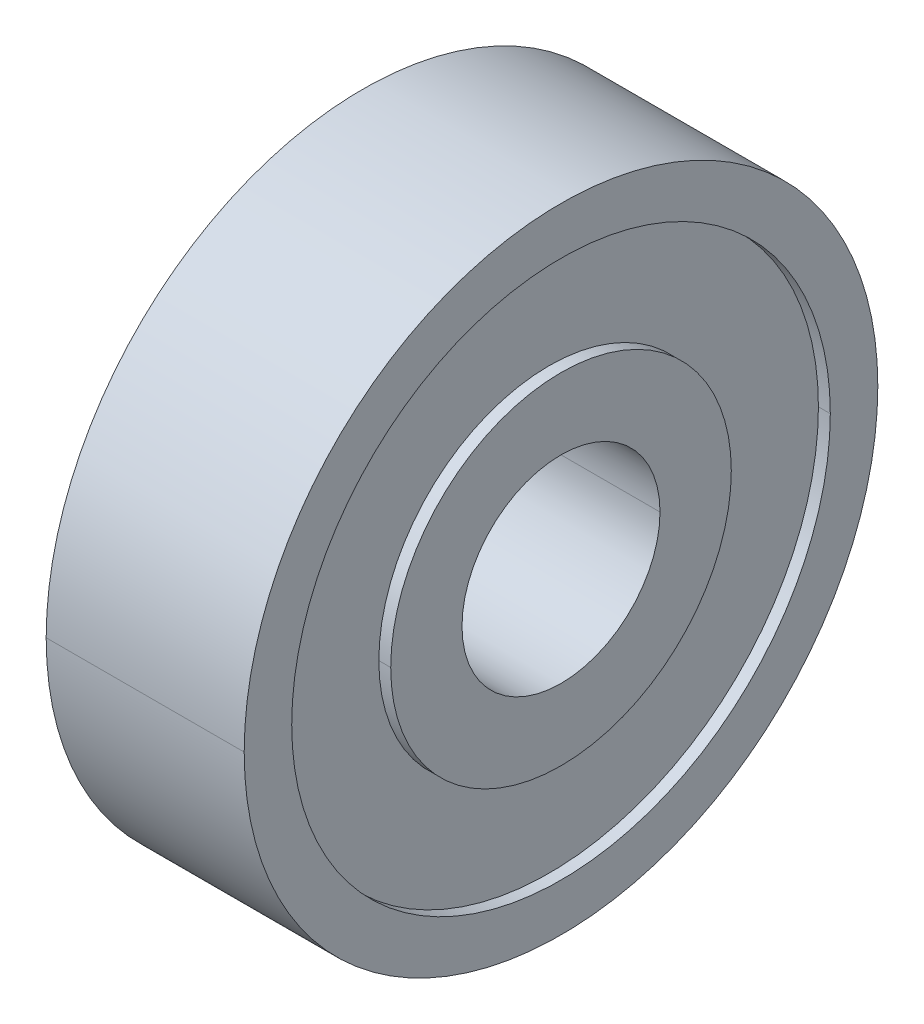
ISO-10303-21;
HEADER;
FILE_DESCRIPTION(('STEP AP214'),'2;1');
FILE_NAME('part.step','',(''),(''),'','','');
FILE_SCHEMA(('AUTOMOTIVE_DESIGN { 1 0 10303 214 1 1 1 1 }'));
ENDSEC;
DATA;
#1=APPLICATION_CONTEXT('core data for automotive mechanical design processes');
#2=APPLICATION_PROTOCOL_DEFINITION('international standard','automotive_design',2000,#1);
#3=PRODUCT_CONTEXT('',#1,'mechanical');
#4=PRODUCT('Part','Part','',(#3));
#5=PRODUCT_RELATED_PRODUCT_CATEGORY('part','',(#4));
#6=PRODUCT_DEFINITION_FORMATION('','',#4);
#7=PRODUCT_DEFINITION_CONTEXT('part definition',#1,'design');
#8=PRODUCT_DEFINITION('design','',#6,#7);
#9=PRODUCT_DEFINITION_SHAPE('','',#8);
#10=(LENGTH_UNIT() NAMED_UNIT(*) SI_UNIT(.MILLI.,.METRE.));
#11=(NAMED_UNIT(*) PLANE_ANGLE_UNIT() SI_UNIT($,.RADIAN.));
#12=(NAMED_UNIT(*) SI_UNIT($,.STERADIAN.) SOLID_ANGLE_UNIT());
#13=UNCERTAINTY_MEASURE_WITH_UNIT(LENGTH_MEASURE(1.E-05),#10,'distance_accuracy_value','');
#14=(GEOMETRIC_REPRESENTATION_CONTEXT(3) GLOBAL_UNCERTAINTY_ASSIGNED_CONTEXT((#13)) GLOBAL_UNIT_ASSIGNED_CONTEXT((#10,
#11,#12)) REPRESENTATION_CONTEXT('',''));
#15=CARTESIAN_POINT('',(0.,0.,0.));
#16=DIRECTION('',(0.,0.,1.));
#17=DIRECTION('',(1.,0.,0.));
#18=AXIS2_PLACEMENT_3D('',#15,#16,#17);
#19=CARTESIAN_POINT('',(0.,0.,0.));
#20=DIRECTION('',(1.,0.,0.));
#21=DIRECTION('',(0.,0.,-1.));
#22=AXIS2_PLACEMENT_3D('',#19,#20,#21);
#23=CYLINDRICAL_SURFACE('',#22,2.5);
#24=DIRECTION('',(1.,0.,0.));
#25=VECTOR('',#24,1.);
#26=CARTESIAN_POINT('',(0.,0.,2.5));
#27=LINE('',#26,#25);
#28=CARTESIAN_POINT('',(-2.5,0.,2.5));
#29=VERTEX_POINT('',#28);
#30=CARTESIAN_POINT('',(2.5,0.,2.5));
#31=VERTEX_POINT('',#30);
#32=EDGE_CURVE('E232',#29,#31,#27,.T.);
#33=ORIENTED_EDGE('',*,*,#32,.F.);
#34=CARTESIAN_POINT('',(-2.5,0.,0.));
#35=DIRECTION('',(1.,0.,0.));
#36=DIRECTION('',(0.,0.,-1.));
#37=AXIS2_PLACEMENT_3D('',#34,#35,#36);
#38=CIRCLE('',#37,2.5);
#39=CARTESIAN_POINT('',(-2.5,0.,-2.5));
#40=VERTEX_POINT('',#39);
#41=EDGE_CURVE('E233',#40,#29,#38,.T.);
#42=ORIENTED_EDGE('',*,*,#41,.F.);
#43=DIRECTION('',(1.,0.,0.));
#44=VECTOR('',#43,1.);
#45=CARTESIAN_POINT('',(0.,0.,-2.5));
#46=LINE('',#45,#44);
#47=CARTESIAN_POINT('',(2.5,0.,-2.5));
#48=VERTEX_POINT('',#47);
#49=EDGE_CURVE('E210',#40,#48,#46,.T.);
#50=ORIENTED_EDGE('',*,*,#49,.T.);
#51=CARTESIAN_POINT('',(2.5,0.,0.));
#52=DIRECTION('',(1.,0.,0.));
#53=DIRECTION('',(0.,0.,-1.));
#54=AXIS2_PLACEMENT_3D('',#51,#52,#53);
#55=CIRCLE('',#54,2.5);
#56=EDGE_CURVE('E11',#48,#31,#55,.T.);
#57=ORIENTED_EDGE('',*,*,#56,.T.);
#58=EDGE_LOOP('',(#33,#42,#50,#57));
#59=FACE_BOUND('',#58,.T.);
#60=ADVANCED_FACE('F16',(#59),#23,.F.);
#61=CARTESIAN_POINT('',(2.5,2.5,0.));
#62=DIRECTION('',(1.,0.,0.));
#63=DIRECTION('',(0.,1.,0.));
#64=AXIS2_PLACEMENT_3D('',#61,#62,#63);
#65=PLANE('',#64);
#66=ORIENTED_EDGE('',*,*,#56,.F.);
#67=CARTESIAN_POINT('',(2.5,0.,0.));
#68=DIRECTION('',(1.,0.,0.));
#69=DIRECTION('',(0.,0.,-1.));
#70=AXIS2_PLACEMENT_3D('',#67,#68,#69);
#71=CIRCLE('',#70,2.5);
#72=EDGE_CURVE('E228',#31,#48,#71,.T.);
#73=ORIENTED_EDGE('',*,*,#72,.F.);
#74=EDGE_LOOP('',(#66,#73));
#75=FACE_BOUND('',#74,.T.);
#76=CARTESIAN_POINT('',(2.5,0.,0.));
#77=DIRECTION('',(1.,0.,0.));
#78=DIRECTION('',(0.,0.,-1.));
#79=AXIS2_PLACEMENT_3D('',#76,#77,#78);
#80=CIRCLE('',#79,4.3);
#81=CARTESIAN_POINT('',(2.5,0.,-4.3));
#82=VERTEX_POINT('',#81);
#83=CARTESIAN_POINT('',(2.5,0.,4.3));
#84=VERTEX_POINT('',#83);
#85=EDGE_CURVE('E196',#82,#84,#80,.T.);
#86=ORIENTED_EDGE('',*,*,#85,.T.);
#87=CARTESIAN_POINT('',(2.5,0.,0.));
#88=DIRECTION('',(1.,0.,0.));
#89=DIRECTION('',(0.,0.,-1.));
#90=AXIS2_PLACEMENT_3D('',#87,#88,#89);
#91=CIRCLE('',#90,4.3);
#92=EDGE_CURVE('E27',#84,#82,#91,.T.);
#93=ORIENTED_EDGE('',*,*,#92,.T.);
#94=EDGE_LOOP('',(#86,#93));
#95=FACE_BOUND('',#94,.T.);
#96=ADVANCED_FACE('F324',(#75,#95),#65,.T.);
#97=CARTESIAN_POINT('',(0.,0.,0.));
#98=DIRECTION('',(1.,0.,0.));
#99=DIRECTION('',(0.,0.,-1.));
#100=AXIS2_PLACEMENT_3D('',#97,#98,#99);
#101=CYLINDRICAL_SURFACE('',#100,4.3);
#102=DIRECTION('',(1.,0.,0.));
#103=VECTOR('',#102,1.);
#104=CARTESIAN_POINT('',(0.,0.,4.3));
#105=LINE('',#104,#103);
#106=CARTESIAN_POINT('',(2.2,0.,4.3));
#107=VERTEX_POINT('',#106);
#108=EDGE_CURVE('E206',#107,#84,#105,.T.);
#109=ORIENTED_EDGE('',*,*,#108,.F.);
#110=CARTESIAN_POINT('',(2.2,0.,0.));
#111=DIRECTION('',(1.,0.,0.));
#112=DIRECTION('',(0.,0.,-1.));
#113=AXIS2_PLACEMENT_3D('',#110,#111,#112);
#114=CIRCLE('',#113,4.3);
#115=CARTESIAN_POINT('',(2.2,0.,-4.3));
#116=VERTEX_POINT('',#115);
#117=EDGE_CURVE('E106',#107,#116,#114,.T.);
#118=ORIENTED_EDGE('',*,*,#117,.T.);
#119=DIRECTION('',(1.,0.,0.));
#120=VECTOR('',#119,1.);
#121=CARTESIAN_POINT('',(0.,0.,-4.3));
#122=LINE('',#121,#120);
#123=EDGE_CURVE('E188',#116,#82,#122,.T.);
#124=ORIENTED_EDGE('',*,*,#123,.T.);
#125=ORIENTED_EDGE('',*,*,#92,.F.);
#126=EDGE_LOOP('',(#109,#118,#124,#125));
#127=FACE_BOUND('',#126,.T.);
#128=ADVANCED_FACE('F330',(#127),#101,.T.);
#129=CARTESIAN_POINT('',(2.2,4.3,0.));
#130=DIRECTION('',(1.,0.,0.));
#131=DIRECTION('',(0.,1.,0.));
#132=AXIS2_PLACEMENT_3D('',#129,#130,#131);
#133=PLANE('',#132);
#134=CARTESIAN_POINT('',(2.2,0.,0.));
#135=DIRECTION('',(1.,0.,0.));
#136=DIRECTION('',(0.,0.,-1.));
#137=AXIS2_PLACEMENT_3D('',#134,#135,#136);
#138=CIRCLE('',#137,4.3);
#139=EDGE_CURVE('E279',#116,#107,#138,.T.);
#140=ORIENTED_EDGE('',*,*,#139,.F.);
#141=ORIENTED_EDGE('',*,*,#117,.F.);
#142=EDGE_LOOP('',(#140,#141));
#143=FACE_BOUND('',#142,.T.);
#144=CARTESIAN_POINT('',(2.2,0.,0.));
#145=DIRECTION('',(1.,0.,0.));
#146=DIRECTION('',(0.,0.,-1.));
#147=AXIS2_PLACEMENT_3D('',#144,#145,#146);
#148=CIRCLE('',#147,6.8);
#149=CARTESIAN_POINT('',(2.2,0.,-6.8));
#150=VERTEX_POINT('',#149);
#151=CARTESIAN_POINT('',(2.2,0.,6.8));
#152=VERTEX_POINT('',#151);
#153=EDGE_CURVE('E168',#150,#152,#148,.T.);
#154=ORIENTED_EDGE('',*,*,#153,.T.);
#155=CARTESIAN_POINT('',(2.2,0.,0.));
#156=DIRECTION('',(1.,0.,0.));
#157=DIRECTION('',(0.,0.,-1.));
#158=AXIS2_PLACEMENT_3D('',#155,#156,#157);
#159=CIRCLE('',#158,6.8);
#160=EDGE_CURVE('E20',#152,#150,#159,.T.);
#161=ORIENTED_EDGE('',*,*,#160,.T.);
#162=EDGE_LOOP('',(#154,#161));
#163=FACE_BOUND('',#162,.T.);
#164=ADVANCED_FACE('F186',(#143,#163),#133,.T.);
#165=CARTESIAN_POINT('',(0.,0.,0.));
#166=DIRECTION('',(1.,0.,0.));
#167=DIRECTION('',(0.,0.,-1.));
#168=AXIS2_PLACEMENT_3D('',#165,#166,#167);
#169=CYLINDRICAL_SURFACE('',#168,6.8);
#170=DIRECTION('',(1.,0.,0.));
#171=VECTOR('',#170,1.);
#172=CARTESIAN_POINT('',(0.,0.,6.8));
#173=LINE('',#172,#171);
#174=CARTESIAN_POINT('',(2.5,0.,6.8));
#175=VERTEX_POINT('',#174);
#176=EDGE_CURVE('E174',#152,#175,#173,.T.);
#177=ORIENTED_EDGE('',*,*,#176,.F.);
#178=ORIENTED_EDGE('',*,*,#153,.F.);
#179=DIRECTION('',(1.,0.,0.));
#180=VECTOR('',#179,1.);
#181=CARTESIAN_POINT('',(0.,0.,-6.8));
#182=LINE('',#181,#180);
#183=CARTESIAN_POINT('',(2.5,0.,-6.8));
#184=VERTEX_POINT('',#183);
#185=EDGE_CURVE('E171',#150,#184,#182,.T.);
#186=ORIENTED_EDGE('',*,*,#185,.T.);
#187=CARTESIAN_POINT('',(2.5,0.,0.));
#188=DIRECTION('',(1.,0.,0.));
#189=DIRECTION('',(0.,0.,-1.));
#190=AXIS2_PLACEMENT_3D('',#187,#188,#189);
#191=CIRCLE('',#190,6.8);
#192=EDGE_CURVE('E162',#184,#175,#191,.T.);
#193=ORIENTED_EDGE('',*,*,#192,.T.);
#194=EDGE_LOOP('',(#177,#178,#186,#193));
#195=FACE_BOUND('',#194,.T.);
#196=ADVANCED_FACE('F170',(#195),#169,.F.);
#197=CARTESIAN_POINT('',(2.5,6.8,0.));
#198=DIRECTION('',(1.,0.,0.));
#199=DIRECTION('',(0.,1.,0.));
#200=AXIS2_PLACEMENT_3D('',#197,#198,#199);
#201=PLANE('',#200);
#202=ORIENTED_EDGE('',*,*,#192,.F.);
#203=CARTESIAN_POINT('',(2.5,0.,0.));
#204=DIRECTION('',(1.,0.,0.));
#205=DIRECTION('',(0.,0.,-1.));
#206=AXIS2_PLACEMENT_3D('',#203,#204,#205);
#207=CIRCLE('',#206,6.8);
#208=EDGE_CURVE('E182',#175,#184,#207,.T.);
#209=ORIENTED_EDGE('',*,*,#208,.F.);
#210=EDGE_LOOP('',(#202,#209));
#211=FACE_BOUND('',#210,.T.);
#212=CARTESIAN_POINT('',(2.5,0.,0.));
#213=DIRECTION('',(1.,0.,0.));
#214=DIRECTION('',(0.,0.,-1.));
#215=AXIS2_PLACEMENT_3D('',#212,#213,#214);
#216=CIRCLE('',#215,8.);
#217=CARTESIAN_POINT('',(2.5,0.,-8.));
#218=VERTEX_POINT('',#217);
#219=CARTESIAN_POINT('',(2.5,0.,8.));
#220=VERTEX_POINT('',#219);
#221=EDGE_CURVE('E224',#218,#220,#216,.T.);
#222=ORIENTED_EDGE('',*,*,#221,.T.);
#223=CARTESIAN_POINT('',(2.5,0.,0.));
#224=DIRECTION('',(1.,0.,0.));
#225=DIRECTION('',(0.,0.,-1.));
#226=AXIS2_PLACEMENT_3D('',#223,#224,#225);
#227=CIRCLE('',#226,8.);
#228=EDGE_CURVE('E212',#220,#218,#227,.T.);
#229=ORIENTED_EDGE('',*,*,#228,.T.);
#230=EDGE_LOOP('',(#222,#229));
#231=FACE_BOUND('',#230,.T.);
#232=ADVANCED_FACE('F361',(#211,#231),#201,.T.);
#233=CARTESIAN_POINT('',(0.,0.,0.));
#234=DIRECTION('',(1.,0.,0.));
#235=DIRECTION('',(0.,0.,-1.));
#236=AXIS2_PLACEMENT_3D('',#233,#234,#235);
#237=CYLINDRICAL_SURFACE('',#236,8.);
#238=DIRECTION('',(1.,0.,0.));
#239=VECTOR('',#238,1.);
#240=CARTESIAN_POINT('',(0.,0.,8.));
#241=LINE('',#240,#239);
#242=CARTESIAN_POINT('',(-2.5,0.,8.));
#243=VERTEX_POINT('',#242);
#244=EDGE_CURVE('E243',#243,#220,#241,.T.);
#245=ORIENTED_EDGE('',*,*,#244,.F.);
#246=CARTESIAN_POINT('',(-2.5,0.,0.));
#247=DIRECTION('',(1.,0.,0.));
#248=DIRECTION('',(0.,0.,-1.));
#249=AXIS2_PLACEMENT_3D('',#246,#247,#248);
#250=CIRCLE('',#249,8.);
#251=CARTESIAN_POINT('',(-2.5,0.,-8.));
#252=VERTEX_POINT('',#251);
#253=EDGE_CURVE('E143',#243,#252,#250,.T.);
#254=ORIENTED_EDGE('',*,*,#253,.T.);
#255=DIRECTION('',(1.,0.,0.));
#256=VECTOR('',#255,1.);
#257=CARTESIAN_POINT('',(0.,0.,-8.));
#258=LINE('',#257,#256);
#259=EDGE_CURVE('E221',#252,#218,#258,.T.);
#260=ORIENTED_EDGE('',*,*,#259,.T.);
#261=ORIENTED_EDGE('',*,*,#228,.F.);
#262=EDGE_LOOP('',(#245,#254,#260,#261));
#263=FACE_BOUND('',#262,.T.);
#264=ADVANCED_FACE('F335',(#263),#237,.T.);
#265=CARTESIAN_POINT('',(-2.5,6.8,0.));
#266=DIRECTION('',(-1.,0.,0.));
#267=DIRECTION('',(0.,0.,1.));
#268=AXIS2_PLACEMENT_3D('',#265,#266,#267);
#269=PLANE('',#268);
#270=CARTESIAN_POINT('',(-2.5,0.,0.));
#271=DIRECTION('',(1.,0.,0.));
#272=DIRECTION('',(0.,0.,-1.));
#273=AXIS2_PLACEMENT_3D('',#270,#271,#272);
#274=CIRCLE('',#273,6.8);
#275=CARTESIAN_POINT('',(-2.5,0.,-6.8));
#276=VERTEX_POINT('',#275);
#277=CARTESIAN_POINT('',(-2.5,0.,6.8));
#278=VERTEX_POINT('',#277);
#279=EDGE_CURVE('E227',#276,#278,#274,.T.);
#280=ORIENTED_EDGE('',*,*,#279,.T.);
#281=CARTESIAN_POINT('',(-2.5,0.,0.));
#282=DIRECTION('',(1.,0.,0.));
#283=DIRECTION('',(0.,0.,-1.));
#284=AXIS2_PLACEMENT_3D('',#281,#282,#283);
#285=CIRCLE('',#284,6.8);
#286=EDGE_CURVE('E216',#278,#276,#285,.T.);
#287=ORIENTED_EDGE('',*,*,#286,.T.);
#288=EDGE_LOOP('',(#280,#287));
#289=FACE_BOUND('',#288,.T.);
#290=CARTESIAN_POINT('',(-2.5,0.,0.));
#291=DIRECTION('',(1.,0.,0.));
#292=DIRECTION('',(0.,0.,-1.));
#293=AXIS2_PLACEMENT_3D('',#290,#291,#292);
#294=CIRCLE('',#293,8.);
#295=EDGE_CURVE('E184',#252,#243,#294,.T.);
#296=ORIENTED_EDGE('',*,*,#295,.F.);
#297=ORIENTED_EDGE('',*,*,#253,.F.);
#298=EDGE_LOOP('',(#296,#297));
#299=FACE_BOUND('',#298,.T.);
#300=ADVANCED_FACE('F320',(#289,#299),#269,.T.);
#301=CARTESIAN_POINT('',(0.,0.,0.));
#302=DIRECTION('',(1.,0.,0.));
#303=DIRECTION('',(0.,0.,-1.));
#304=AXIS2_PLACEMENT_3D('',#301,#302,#303);
#305=CYLINDRICAL_SURFACE('',#304,6.8);
#306=DIRECTION('',(1.,0.,0.));
#307=VECTOR('',#306,1.);
#308=CARTESIAN_POINT('',(0.,0.,6.8));
#309=LINE('',#308,#307);
#310=CARTESIAN_POINT('',(-2.2,0.,6.8));
#311=VERTEX_POINT('',#310);
#312=EDGE_CURVE('E220',#278,#311,#309,.T.);
#313=ORIENTED_EDGE('',*,*,#312,.F.);
#314=ORIENTED_EDGE('',*,*,#279,.F.);
#315=DIRECTION('',(1.,0.,0.));
#316=VECTOR('',#315,1.);
#317=CARTESIAN_POINT('',(0.,0.,-6.8));
#318=LINE('',#317,#316);
#319=CARTESIAN_POINT('',(-2.2,0.,-6.8));
#320=VERTEX_POINT('',#319);
#321=EDGE_CURVE('E248',#276,#320,#318,.T.);
#322=ORIENTED_EDGE('',*,*,#321,.T.);
#323=CARTESIAN_POINT('',(-2.2,0.,0.));
#324=DIRECTION('',(1.,0.,0.));
#325=DIRECTION('',(0.,0.,-1.));
#326=AXIS2_PLACEMENT_3D('',#323,#324,#325);
#327=CIRCLE('',#326,6.8);
#328=EDGE_CURVE('E76',#320,#311,#327,.T.);
#329=ORIENTED_EDGE('',*,*,#328,.T.);
#330=EDGE_LOOP('',(#313,#314,#322,#329));
#331=FACE_BOUND('',#330,.T.);
#332=ADVANCED_FACE('F306',(#331),#305,.F.);
#333=CARTESIAN_POINT('',(-2.2,4.3,0.));
#334=DIRECTION('',(-1.,0.,0.));
#335=DIRECTION('',(0.,0.,1.));
#336=AXIS2_PLACEMENT_3D('',#333,#334,#335);
#337=PLANE('',#336);
#338=CARTESIAN_POINT('',(-2.2,0.,0.));
#339=DIRECTION('',(1.,0.,0.));
#340=DIRECTION('',(0.,0.,-1.));
#341=AXIS2_PLACEMENT_3D('',#338,#339,#340);
#342=CIRCLE('',#341,4.3);
#343=CARTESIAN_POINT('',(-2.2,0.,-4.3));
#344=VERTEX_POINT('',#343);
#345=CARTESIAN_POINT('',(-2.2,0.,4.3));
#346=VERTEX_POINT('',#345);
#347=EDGE_CURVE('E253',#344,#346,#342,.T.);
#348=ORIENTED_EDGE('',*,*,#347,.T.);
#349=CARTESIAN_POINT('',(-2.2,0.,0.));
#350=DIRECTION('',(1.,0.,0.));
#351=DIRECTION('',(0.,0.,-1.));
#352=AXIS2_PLACEMENT_3D('',#349,#350,#351);
#353=CIRCLE('',#352,4.3);
#354=EDGE_CURVE('E40',#346,#344,#353,.T.);
#355=ORIENTED_EDGE('',*,*,#354,.T.);
#356=EDGE_LOOP('',(#348,#355));
#357=FACE_BOUND('',#356,.T.);
#358=ORIENTED_EDGE('',*,*,#328,.F.);
#359=CARTESIAN_POINT('',(-2.2,0.,0.));
#360=DIRECTION('',(1.,0.,0.));
#361=DIRECTION('',(0.,0.,-1.));
#362=AXIS2_PLACEMENT_3D('',#359,#360,#361);
#363=CIRCLE('',#362,6.8);
#364=EDGE_CURVE('E244',#311,#320,#363,.T.);
#365=ORIENTED_EDGE('',*,*,#364,.F.);
#366=EDGE_LOOP('',(#358,#365));
#367=FACE_BOUND('',#366,.T.);
#368=ADVANCED_FACE('F310',(#357,#367),#337,.T.);
#369=CARTESIAN_POINT('',(0.,0.,0.));
#370=DIRECTION('',(1.,0.,0.));
#371=DIRECTION('',(0.,0.,-1.));
#372=AXIS2_PLACEMENT_3D('',#369,#370,#371);
#373=CYLINDRICAL_SURFACE('',#372,4.3);
#374=DIRECTION('',(1.,0.,0.));
#375=VECTOR('',#374,1.);
#376=CARTESIAN_POINT('',(0.,0.,4.3));
#377=LINE('',#376,#375);
#378=CARTESIAN_POINT('',(-2.5,0.,4.3));
#379=VERTEX_POINT('',#378);
#380=EDGE_CURVE('E249',#379,#346,#377,.T.);
#381=ORIENTED_EDGE('',*,*,#380,.F.);
#382=CARTESIAN_POINT('',(-2.5,0.,0.));
#383=DIRECTION('',(1.,0.,0.));
#384=DIRECTION('',(0.,0.,-1.));
#385=AXIS2_PLACEMENT_3D('',#382,#383,#384);
#386=CIRCLE('',#385,4.3);
#387=CARTESIAN_POINT('',(-2.5,0.,-4.3));
#388=VERTEX_POINT('',#387);
#389=EDGE_CURVE('E88',#379,#388,#386,.T.);
#390=ORIENTED_EDGE('',*,*,#389,.T.);
#391=DIRECTION('',(1.,0.,0.));
#392=VECTOR('',#391,1.);
#393=CARTESIAN_POINT('',(0.,0.,-4.3));
#394=LINE('',#393,#392);
#395=EDGE_CURVE('E255',#388,#344,#394,.T.);
#396=ORIENTED_EDGE('',*,*,#395,.T.);
#397=ORIENTED_EDGE('',*,*,#354,.F.);
#398=EDGE_LOOP('',(#381,#390,#396,#397));
#399=FACE_BOUND('',#398,.T.);
#400=ADVANCED_FACE('F312',(#399),#373,.T.);
#401=CARTESIAN_POINT('',(-2.5,2.5,0.));
#402=DIRECTION('',(-1.,0.,0.));
#403=DIRECTION('',(0.,0.,1.));
#404=AXIS2_PLACEMENT_3D('',#401,#402,#403);
#405=PLANE('',#404);
#406=ORIENTED_EDGE('',*,*,#41,.T.);
#407=CARTESIAN_POINT('',(-2.5,0.,0.));
#408=DIRECTION('',(1.,0.,0.));
#409=DIRECTION('',(0.,0.,-1.));
#410=AXIS2_PLACEMENT_3D('',#407,#408,#409);
#411=CIRCLE('',#410,2.5);
#412=EDGE_CURVE('E236',#29,#40,#411,.T.);
#413=ORIENTED_EDGE('',*,*,#412,.T.);
#414=EDGE_LOOP('',(#406,#413));
#415=FACE_BOUND('',#414,.T.);
#416=CARTESIAN_POINT('',(-2.5,0.,0.));
#417=DIRECTION('',(1.,0.,0.));
#418=DIRECTION('',(0.,0.,-1.));
#419=AXIS2_PLACEMENT_3D('',#416,#417,#418);
#420=CIRCLE('',#419,4.3);
#421=EDGE_CURVE('E254',#388,#379,#420,.T.);
#422=ORIENTED_EDGE('',*,*,#421,.F.);
#423=ORIENTED_EDGE('',*,*,#389,.F.);
#424=EDGE_LOOP('',(#422,#423));
#425=FACE_BOUND('',#424,.T.);
#426=ADVANCED_FACE('F18',(#415,#425),#405,.T.);
#427=CARTESIAN_POINT('',(0.,0.,0.));
#428=DIRECTION('',(1.,0.,0.));
#429=DIRECTION('',(0.,0.,-1.));
#430=AXIS2_PLACEMENT_3D('',#427,#428,#429);
#431=CYLINDRICAL_SURFACE('',#430,4.3);
#432=ORIENTED_EDGE('',*,*,#421,.T.);
#433=ORIENTED_EDGE('',*,*,#380,.T.);
#434=ORIENTED_EDGE('',*,*,#347,.F.);
#435=ORIENTED_EDGE('',*,*,#395,.F.);
#436=EDGE_LOOP('',(#432,#433,#434,#435));
#437=FACE_BOUND('',#436,.T.);
#438=ADVANCED_FACE('F350',(#437),#431,.T.);
#439=CARTESIAN_POINT('',(0.,0.,0.));
#440=DIRECTION('',(1.,0.,0.));
#441=DIRECTION('',(0.,0.,-1.));
#442=AXIS2_PLACEMENT_3D('',#439,#440,#441);
#443=CYLINDRICAL_SURFACE('',#442,6.8);
#444=ORIENTED_EDGE('',*,*,#286,.F.);
#445=ORIENTED_EDGE('',*,*,#312,.T.);
#446=ORIENTED_EDGE('',*,*,#364,.T.);
#447=ORIENTED_EDGE('',*,*,#321,.F.);
#448=EDGE_LOOP('',(#444,#445,#446,#447));
#449=FACE_BOUND('',#448,.T.);
#450=ADVANCED_FACE('F309',(#449),#443,.F.);
#451=CARTESIAN_POINT('',(0.,0.,0.));
#452=DIRECTION('',(1.,0.,0.));
#453=DIRECTION('',(0.,0.,-1.));
#454=AXIS2_PLACEMENT_3D('',#451,#452,#453);
#455=CYLINDRICAL_SURFACE('',#454,8.);
#456=ORIENTED_EDGE('',*,*,#295,.T.);
#457=ORIENTED_EDGE('',*,*,#244,.T.);
#458=ORIENTED_EDGE('',*,*,#221,.F.);
#459=ORIENTED_EDGE('',*,*,#259,.F.);
#460=EDGE_LOOP('',(#456,#457,#458,#459));
#461=FACE_BOUND('',#460,.T.);
#462=ADVANCED_FACE('F338',(#461),#455,.T.);
#463=CARTESIAN_POINT('',(0.,0.,0.));
#464=DIRECTION('',(1.,0.,0.));
#465=DIRECTION('',(0.,0.,-1.));
#466=AXIS2_PLACEMENT_3D('',#463,#464,#465);
#467=CYLINDRICAL_SURFACE('',#466,6.8);
#468=ORIENTED_EDGE('',*,*,#160,.F.);
#469=ORIENTED_EDGE('',*,*,#176,.T.);
#470=ORIENTED_EDGE('',*,*,#208,.T.);
#471=ORIENTED_EDGE('',*,*,#185,.F.);
#472=EDGE_LOOP('',(#468,#469,#470,#471));
#473=FACE_BOUND('',#472,.T.);
#474=ADVANCED_FACE('F181',(#473),#467,.F.);
#475=CARTESIAN_POINT('',(0.,0.,0.));
#476=DIRECTION('',(1.,0.,0.));
#477=DIRECTION('',(0.,0.,-1.));
#478=AXIS2_PLACEMENT_3D('',#475,#476,#477);
#479=CYLINDRICAL_SURFACE('',#478,4.3);
#480=ORIENTED_EDGE('',*,*,#139,.T.);
#481=ORIENTED_EDGE('',*,*,#108,.T.);
#482=ORIENTED_EDGE('',*,*,#85,.F.);
#483=ORIENTED_EDGE('',*,*,#123,.F.);
#484=EDGE_LOOP('',(#480,#481,#482,#483));
#485=FACE_BOUND('',#484,.T.);
#486=ADVANCED_FACE('F337',(#485),#479,.T.);
#487=CARTESIAN_POINT('',(0.,0.,0.));
#488=DIRECTION('',(1.,0.,0.));
#489=DIRECTION('',(0.,0.,-1.));
#490=AXIS2_PLACEMENT_3D('',#487,#488,#489);
#491=CYLINDRICAL_SURFACE('',#490,2.5);
#492=ORIENTED_EDGE('',*,*,#412,.F.);
#493=ORIENTED_EDGE('',*,*,#32,.T.);
#494=ORIENTED_EDGE('',*,*,#72,.T.);
#495=ORIENTED_EDGE('',*,*,#49,.F.);
#496=EDGE_LOOP('',(#492,#493,#494,#495));
#497=FACE_BOUND('',#496,.T.);
#498=ADVANCED_FACE('F343',(#497),#491,.F.);
#499=CLOSED_SHELL('',(#60,#96,#128,#164,#196,#232,#264,#300,#332,#368,#400,#426,#438,#450,#462,
#474,#486,#498));
#500=MANIFOLD_SOLID_BREP('B1',#499);
#501=ADVANCED_BREP_SHAPE_REPRESENTATION('',(#18,#500),#14);
#502=SHAPE_DEFINITION_REPRESENTATION(#9,#501);
ENDSEC;
END-ISO-10303-21;
